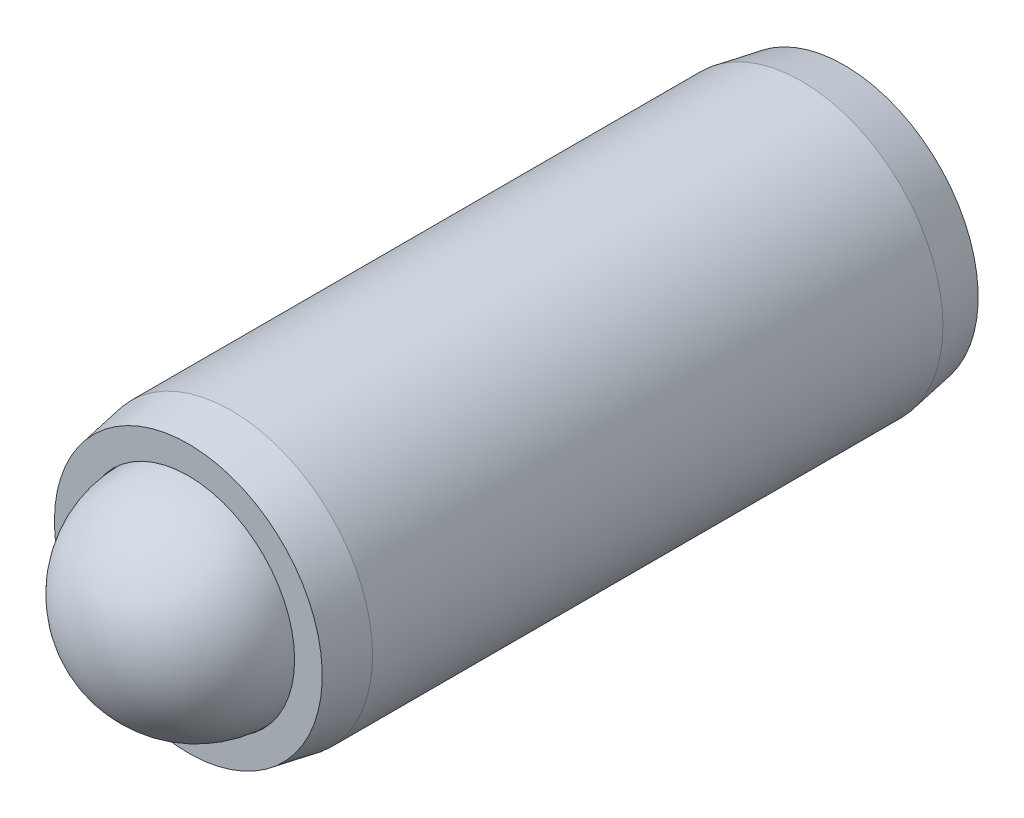
ISO-10303-21;
HEADER;
FILE_DESCRIPTION(('STEP AP214'),'2;1');
FILE_NAME('part.step','',(''),(''),'','','');
FILE_SCHEMA(('AUTOMOTIVE_DESIGN { 1 0 10303 214 1 1 1 1 }'));
ENDSEC;
DATA;
#1=APPLICATION_CONTEXT('core data for automotive mechanical design processes');
#2=APPLICATION_PROTOCOL_DEFINITION('international standard','automotive_design',2000,#1);
#3=PRODUCT_CONTEXT('',#1,'mechanical');
#4=PRODUCT('Part','Part','',(#3));
#5=PRODUCT_RELATED_PRODUCT_CATEGORY('part','',(#4));
#6=PRODUCT_DEFINITION_FORMATION('','',#4);
#7=PRODUCT_DEFINITION_CONTEXT('part definition',#1,'design');
#8=PRODUCT_DEFINITION('design','',#6,#7);
#9=PRODUCT_DEFINITION_SHAPE('','',#8);
#10=(LENGTH_UNIT() NAMED_UNIT(*) SI_UNIT(.MILLI.,.METRE.));
#11=(NAMED_UNIT(*) PLANE_ANGLE_UNIT() SI_UNIT($,.RADIAN.));
#12=(NAMED_UNIT(*) SI_UNIT($,.STERADIAN.) SOLID_ANGLE_UNIT());
#13=UNCERTAINTY_MEASURE_WITH_UNIT(LENGTH_MEASURE(1.E-05),#10,'distance_accuracy_value','');
#14=(GEOMETRIC_REPRESENTATION_CONTEXT(3) GLOBAL_UNCERTAINTY_ASSIGNED_CONTEXT((#13)) GLOBAL_UNIT_ASSIGNED_CONTEXT((#10,
#11,#12)) REPRESENTATION_CONTEXT('',''));
#15=CARTESIAN_POINT('',(0.,0.,0.));
#16=DIRECTION('',(0.,0.,1.));
#17=DIRECTION('',(1.,0.,0.));
#18=AXIS2_PLACEMENT_3D('',#15,#16,#17);
#19=CARTESIAN_POINT('',(12.4479058846987,0.114095203514354,4.14095762168604));
#20=DIRECTION('',(-0.501783450752555,0.0991728860270872,0.859289303568895));
#21=DIRECTION('',(0.424889384230263,0.893559081168465,0.144986825711152));
#22=AXIS2_PLACEMENT_3D('',#19,#20,#21);
#23=SPHERICAL_SURFACE('',#22,3.571875);
#24=CARTESIAN_POINT('',(10.6555981215419,0.468328355792356,7.21023160287119));
#25=VERTEX_POINT('',#24);
#26=VERTEX_LOOP('',#25);
#27=FACE_BOUND('',#26,.T.);
#28=ADVANCED_FACE('P0_F12',(#27),#23,.T.);
#29=CLOSED_SHELL('',(#28));
#30=MANIFOLD_SOLID_BREP('P0_B1',#29);
#31=CARTESIAN_POINT('',(12.4479058846987,0.114095203514353,-17.687167378314));
#32=DIRECTION('',(0.,0.,1.));
#33=DIRECTION('',(1.,0.,0.));
#34=AXIS2_PLACEMENT_3D('',#31,#32,#33);
#35=CONICAL_SURFACE('',#34,4.5085,0.174532925199426);
#36=CARTESIAN_POINT('',(12.4479058846987,0.114095203514353,-16.246661796131));
#37=DIRECTION('',(0.,0.,-1.));
#38=DIRECTION('',(-1.,0.,0.));
#39=AXIS2_PLACEMENT_3D('',#36,#37,#38);
#40=CIRCLE('',#39,4.7625);
#41=CARTESIAN_POINT('',(7.68540588469869,0.114095203514353,-16.246661796131));
#42=VERTEX_POINT('',#41);
#43=EDGE_CURVE('P1_E149',#42,#42,#40,.T.);
#44=ORIENTED_EDGE('',*,*,#43,.T.);
#45=EDGE_LOOP('',(#44));
#46=FACE_BOUND('',#45,.T.);
#47=CARTESIAN_POINT('',(12.4479058846987,0.114095203514353,-17.687167378314));
#48=DIRECTION('',(0.,0.,-1.));
#49=DIRECTION('',(-1.,0.,0.));
#50=AXIS2_PLACEMENT_3D('',#47,#48,#49);
#51=CIRCLE('',#50,4.5085);
#52=CARTESIAN_POINT('',(7.93940588469868,0.114095203514353,-17.687167378314));
#53=VERTEX_POINT('',#52);
#54=EDGE_CURVE('P1_E125',#53,#53,#51,.T.);
#55=ORIENTED_EDGE('',*,*,#54,.F.);
#56=EDGE_LOOP('',(#55));
#57=FACE_BOUND('',#56,.T.);
#58=ADVANCED_FACE('P1_F15',(#46,#57),#35,.T.);
#59=CARTESIAN_POINT('',(12.4479058846987,0.114095203514353,-0.910436446415391));
#60=DIRECTION('',(0.,0.,-1.));
#61=DIRECTION('',(-1.,0.,0.));
#62=AXIS2_PLACEMENT_3D('',#59,#60,#61);
#63=CYLINDRICAL_SURFACE('',#62,4.7625);
#64=CARTESIAN_POINT('',(12.4479058846987,0.114095203514353,2.95445203950315));
#65=DIRECTION('',(0.,0.,-1.));
#66=DIRECTION('',(-1.,0.,0.));
#67=AXIS2_PLACEMENT_3D('',#64,#65,#66);
#68=CIRCLE('',#67,4.7625);
#69=CARTESIAN_POINT('',(7.68540588469869,0.114095203514353,2.95445203950315));
#70=VERTEX_POINT('',#69);
#71=EDGE_CURVE('P1_E146',#70,#70,#68,.T.);
#72=ORIENTED_EDGE('',*,*,#71,.T.);
#73=EDGE_LOOP('',(#72));
#74=FACE_BOUND('',#73,.T.);
#75=ORIENTED_EDGE('',*,*,#43,.F.);
#76=EDGE_LOOP('',(#75));
#77=FACE_BOUND('',#76,.T.);
#78=ADVANCED_FACE('P1_F218',(#74,#77),#63,.T.);
#79=CARTESIAN_POINT('',(12.4479058846987,0.114095203514353,2.95445203950315));
#80=DIRECTION('',(0.,0.,-1.));
#81=DIRECTION('',(-1.,0.,0.));
#82=AXIS2_PLACEMENT_3D('',#79,#80,#81);
#83=CONICAL_SURFACE('',#82,4.7625,0.174532925199434);
#84=CARTESIAN_POINT('',(12.4479058846987,0.114095203514353,4.39495762168604));
#85=DIRECTION('',(0.,0.,-1.));
#86=DIRECTION('',(-1.,0.,0.));
#87=AXIS2_PLACEMENT_3D('',#84,#85,#86);
#88=CIRCLE('',#87,4.5085);
#89=CARTESIAN_POINT('',(7.93940588469868,0.114095203514353,4.39495762168604));
#90=VERTEX_POINT('',#89);
#91=EDGE_CURVE('P1_E143',#90,#90,#88,.T.);
#92=ORIENTED_EDGE('',*,*,#91,.T.);
#93=EDGE_LOOP('',(#92));
#94=FACE_BOUND('',#93,.T.);
#95=ORIENTED_EDGE('',*,*,#71,.F.);
#96=EDGE_LOOP('',(#95));
#97=FACE_BOUND('',#96,.T.);
#98=ADVANCED_FACE('P1_F224',(#94,#97),#83,.T.);
#99=CARTESIAN_POINT('',(12.4479058846987,4.62259520351435,4.39495762168604));
#100=DIRECTION('',(0.,0.,1.));
#101=DIRECTION('',(1.,0.,0.));
#102=AXIS2_PLACEMENT_3D('',#99,#100,#101);
#103=PLANE('',#102);
#104=CARTESIAN_POINT('',(12.4479058846987,0.114095203514353,4.39495762168604));
#105=DIRECTION('',(0.,0.,-1.));
#106=DIRECTION('',(-1.,0.,0.));
#107=AXIS2_PLACEMENT_3D('',#104,#105,#106);
#108=CIRCLE('',#107,3.578225);
#109=CARTESIAN_POINT('',(8.86968088469868,0.114095203514353,4.39495762168604));
#110=VERTEX_POINT('',#109);
#111=EDGE_CURVE('P1_E140',#110,#110,#108,.T.);
#112=ORIENTED_EDGE('',*,*,#111,.T.);
#113=EDGE_LOOP('',(#112));
#114=FACE_BOUND('',#113,.T.);
#115=ORIENTED_EDGE('',*,*,#91,.F.);
#116=EDGE_LOOP('',(#115));
#117=FACE_BOUND('',#116,.T.);
#118=ADVANCED_FACE('P1_F360',(#114,#117),#103,.T.);
#119=CARTESIAN_POINT('',(12.4479058846987,0.114095203514353,-0.910436446415391));
#120=DIRECTION('',(0.,0.,-1.));
#121=DIRECTION('',(-1.,0.,0.));
#122=AXIS2_PLACEMENT_3D('',#119,#120,#121);
#123=CYLINDRICAL_SURFACE('',#122,3.578225);
#124=CARTESIAN_POINT('',(12.4479058846987,0.114095203514353,2.66778855358465));
#125=DIRECTION('',(0.,0.,-1.));
#126=DIRECTION('',(-1.,0.,0.));
#127=AXIS2_PLACEMENT_3D('',#124,#125,#126);
#128=CIRCLE('',#127,3.578225);
#129=CARTESIAN_POINT('',(8.86968088469868,0.114095203514353,2.66778855358465));
#130=VERTEX_POINT('',#129);
#131=EDGE_CURVE('P1_E137',#130,#130,#128,.T.);
#132=ORIENTED_EDGE('',*,*,#131,.T.);
#133=EDGE_LOOP('',(#132));
#134=FACE_BOUND('',#133,.T.);
#135=ORIENTED_EDGE('',*,*,#111,.F.);
#136=EDGE_LOOP('',(#135));
#137=FACE_BOUND('',#136,.T.);
#138=ADVANCED_FACE('P1_F351',(#134,#137),#123,.F.);
#139=CARTESIAN_POINT('',(12.4479058846987,0.114095203514353,2.66778855358465));
#140=DIRECTION('',(0.,0.,1.));
#141=DIRECTION('',(1.,0.,0.));
#142=AXIS2_PLACEMENT_3D('',#139,#140,#141);
#143=CONICAL_SURFACE('',#142,3.578225,0.785398163397443);
#144=CARTESIAN_POINT('',(12.4479058846987,0.114095203514353,-0.910436446415391));
#145=VERTEX_POINT('',#144);
#146=VERTEX_LOOP('',#145);
#147=FACE_BOUND('',#146,.T.);
#148=ORIENTED_EDGE('',*,*,#131,.F.);
#149=EDGE_LOOP('',(#148));
#150=FACE_BOUND('',#149,.T.);
#151=ADVANCED_FACE('P1_F342',(#147,#150),#143,.F.);
#152=CARTESIAN_POINT('',(12.4479058846987,4.62259520351435,-17.687167378314));
#153=DIRECTION('',(0.,0.,-1.));
#154=DIRECTION('',(-1.,0.,0.));
#155=AXIS2_PLACEMENT_3D('',#152,#153,#154);
#156=PLANE('',#155);
#157=DIRECTION('',(1.,0.,0.));
#158=VECTOR('',#157,1.);
#159=CARTESIAN_POINT('',(13.8227212132065,-2.52115479648565,-17.687167378314));
#160=LINE('',#159,#158);
#161=CARTESIAN_POINT('',(10.9264435878167,-2.52115479648565,-17.687167378314));
#162=VERTEX_POINT('',#161);
#163=CARTESIAN_POINT('',(13.9693681815806,-2.52115479648565,-17.687167378314));
#164=VERTEX_POINT('',#163);
#165=EDGE_CURVE('P1_E163',#162,#164,#160,.T.);
#166=ORIENTED_EDGE('',*,*,#165,.T.);
#167=DIRECTION('',(0.5,0.866025403784439,0.));
#168=VECTOR('',#167,1.);
#169=CARTESIAN_POINT('',(15.4175069942755,-0.0129047964856495,-17.687167378314));
#170=LINE('',#169,#168);
#171=CARTESIAN_POINT('',(15.4908304784626,0.114095203514353,-17.687167378314));
#172=VERTEX_POINT('',#171);
#173=EDGE_CURVE('P1_E165',#164,#172,#170,.T.);
#174=ORIENTED_EDGE('',*,*,#173,.T.);
#175=DIRECTION('',(-0.5,0.866025403784439,0.));
#176=VECTOR('',#175,1.);
#177=CARTESIAN_POINT('',(14.0426916657677,2.62234520351436,-17.687167378314));
#178=LINE('',#177,#176);
#179=CARTESIAN_POINT('',(13.9693681815806,2.74934520351436,-17.687167378314));
#180=VERTEX_POINT('',#179);
#181=EDGE_CURVE('P1_E155',#172,#180,#178,.T.);
#182=ORIENTED_EDGE('',*,*,#181,.T.);
#183=DIRECTION('',(-1.,0.,0.));
#184=VECTOR('',#183,1.);
#185=CARTESIAN_POINT('',(11.0730905561909,2.74934520351436,-17.687167378314));
#186=LINE('',#185,#184);
#187=CARTESIAN_POINT('',(10.9264435878167,2.74934520351436,-17.687167378314));
#188=VERTEX_POINT('',#187);
#189=EDGE_CURVE('P1_E157',#180,#188,#186,.T.);
#190=ORIENTED_EDGE('',*,*,#189,.T.);
#191=DIRECTION('',(-0.5,-0.866025403784438,0.));
#192=VECTOR('',#191,1.);
#193=CARTESIAN_POINT('',(9.47830477512184,0.241095203514354,-17.687167378314));
#194=LINE('',#193,#192);
#195=CARTESIAN_POINT('',(9.40498129093475,0.114095203514352,-17.687167378314));
#196=VERTEX_POINT('',#195);
#197=EDGE_CURVE('P1_E159',#188,#196,#194,.T.);
#198=ORIENTED_EDGE('',*,*,#197,.T.);
#199=DIRECTION('',(0.5,-0.866025403784439,0.));
#200=VECTOR('',#199,1.);
#201=CARTESIAN_POINT('',(10.8531201036296,-2.39415479648565,-17.687167378314));
#202=LINE('',#201,#200);
#203=EDGE_CURVE('P1_E161',#196,#162,#202,.T.);
#204=ORIENTED_EDGE('',*,*,#203,.T.);
#205=EDGE_LOOP('',(#166,#174,#182,#190,#198,#204));
#206=FACE_BOUND('',#205,.T.);
#207=ORIENTED_EDGE('',*,*,#54,.T.);
#208=EDGE_LOOP('',(#207));
#209=FACE_BOUND('',#208,.T.);
#210=ADVANCED_FACE('P1_F334',(#206,#209),#156,.T.);
#211=CARTESIAN_POINT('',(11.0730905561909,-2.26715479648565,-12.607167378314));
#212=DIRECTION('',(-0.866025403784439,-0.5,0.));
#213=DIRECTION('',(0.5,-0.866025403784439,0.));
#214=AXIS2_PLACEMENT_3D('',#211,#212,#213);
#215=PLANE('',#214);
#216=DIRECTION('',(0.,0.,-1.));
#217=VECTOR('',#216,1.);
#218=CARTESIAN_POINT('',(11.0730905561909,-2.26715479648565,-12.607167378314));
#219=LINE('',#218,#217);
#220=CARTESIAN_POINT('',(11.0730905561909,-2.26715479648565,-12.607167378314));
#221=VERTEX_POINT('',#220);
#222=CARTESIAN_POINT('',(11.0730905561909,-2.26715479648565,-17.433167378314));
#223=VERTEX_POINT('',#222);
#224=EDGE_CURVE('P1_E123',#221,#223,#219,.T.);
#225=ORIENTED_EDGE('',*,*,#224,.T.);
#226=DIRECTION('',(-0.5,0.866025403784439,0.));
#227=VECTOR('',#226,1.);
#228=CARTESIAN_POINT('',(9.69827522768309,0.114095203514351,-17.433167378314));
#229=LINE('',#228,#227);
#230=CARTESIAN_POINT('',(9.69827522768309,0.114095203514352,-17.433167378314));
#231=VERTEX_POINT('',#230);
#232=EDGE_CURVE('P1_E97',#223,#231,#229,.T.);
#233=ORIENTED_EDGE('',*,*,#232,.T.);
#234=DIRECTION('',(0.,0.,-1.));
#235=VECTOR('',#234,1.);
#236=CARTESIAN_POINT('',(9.69827522768309,0.114095203514352,-12.607167378314));
#237=LINE('',#236,#235);
#238=CARTESIAN_POINT('',(9.69827522768309,0.114095203514352,-12.607167378314));
#239=VERTEX_POINT('',#238);
#240=EDGE_CURVE('P1_E89',#239,#231,#237,.T.);
#241=ORIENTED_EDGE('',*,*,#240,.F.);
#242=DIRECTION('',(-0.5,0.866025403784439,0.));
#243=VECTOR('',#242,1.);
#244=CARTESIAN_POINT('',(11.0730905561909,-2.26715479648565,-12.607167378314));
#245=LINE('',#244,#243);
#246=EDGE_CURVE('P1_E94',#221,#239,#245,.T.);
#247=ORIENTED_EDGE('',*,*,#246,.F.);
#248=EDGE_LOOP('',(#225,#233,#241,#247));
#249=FACE_BOUND('',#248,.T.);
#250=ADVANCED_FACE('P1_F92',(#249),#215,.F.);
#251=CARTESIAN_POINT('',(13.8227212132065,-2.26715479648565,-12.607167378314));
#252=DIRECTION('',(0.,-1.,0.));
#253=DIRECTION('',(1.,0.,0.));
#254=AXIS2_PLACEMENT_3D('',#251,#252,#253);
#255=PLANE('',#254);
#256=DIRECTION('',(0.,0.,-1.));
#257=VECTOR('',#256,1.);
#258=CARTESIAN_POINT('',(13.8227212132065,-2.26715479648565,-12.607167378314));
#259=LINE('',#258,#257);
#260=CARTESIAN_POINT('',(13.8227212132065,-2.26715479648565,-12.607167378314));
#261=VERTEX_POINT('',#260);
#262=CARTESIAN_POINT('',(13.8227212132065,-2.26715479648565,-17.433167378314));
#263=VERTEX_POINT('',#262);
#264=EDGE_CURVE('P1_E126',#261,#263,#259,.T.);
#265=ORIENTED_EDGE('',*,*,#264,.T.);
#266=DIRECTION('',(-1.,0.,0.));
#267=VECTOR('',#266,1.);
#268=CARTESIAN_POINT('',(11.0730905561909,-2.26715479648565,-17.433167378314));
#269=LINE('',#268,#267);
#270=EDGE_CURVE('P1_E168',#263,#223,#269,.T.);
#271=ORIENTED_EDGE('',*,*,#270,.T.);
#272=ORIENTED_EDGE('',*,*,#224,.F.);
#273=DIRECTION('',(-1.,0.,0.));
#274=VECTOR('',#273,1.);
#275=CARTESIAN_POINT('',(13.8227212132065,-2.26715479648565,-12.607167378314));
#276=LINE('',#275,#274);
#277=EDGE_CURVE('P1_E99',#261,#221,#276,.T.);
#278=ORIENTED_EDGE('',*,*,#277,.F.);
#279=EDGE_LOOP('',(#265,#271,#272,#278));
#280=FACE_BOUND('',#279,.T.);
#281=ADVANCED_FACE('P1_F252',(#280),#255,.F.);
#282=CARTESIAN_POINT('',(15.1975365417143,0.114095203514353,-12.607167378314));
#283=DIRECTION('',(0.866025403784438,-0.5,0.));
#284=DIRECTION('',(0.5,0.866025403784438,0.));
#285=AXIS2_PLACEMENT_3D('',#282,#283,#284);
#286=PLANE('',#285);
#287=DIRECTION('',(0.,0.,-1.));
#288=VECTOR('',#287,1.);
#289=CARTESIAN_POINT('',(15.1975365417143,0.114095203514353,-12.607167378314));
#290=LINE('',#289,#288);
#291=CARTESIAN_POINT('',(15.1975365417143,0.114095203514353,-12.607167378314));
#292=VERTEX_POINT('',#291);
#293=CARTESIAN_POINT('',(15.1975365417143,0.114095203514353,-17.433167378314));
#294=VERTEX_POINT('',#293);
#295=EDGE_CURVE('P1_E129',#292,#294,#290,.T.);
#296=ORIENTED_EDGE('',*,*,#295,.T.);
#297=DIRECTION('',(-0.5,-0.866025403784438,0.));
#298=VECTOR('',#297,1.);
#299=CARTESIAN_POINT('',(13.8227212132065,-2.26715479648565,-17.433167378314));
#300=LINE('',#299,#298);
#301=EDGE_CURVE('P1_E152',#294,#263,#300,.T.);
#302=ORIENTED_EDGE('',*,*,#301,.T.);
#303=ORIENTED_EDGE('',*,*,#264,.F.);
#304=DIRECTION('',(-0.5,-0.866025403784438,0.));
#305=VECTOR('',#304,1.);
#306=CARTESIAN_POINT('',(15.1975365417143,0.114095203514353,-12.607167378314));
#307=LINE('',#306,#305);
#308=EDGE_CURVE('P1_E120',#292,#261,#307,.T.);
#309=ORIENTED_EDGE('',*,*,#308,.F.);
#310=EDGE_LOOP('',(#296,#302,#303,#309));
#311=FACE_BOUND('',#310,.T.);
#312=ADVANCED_FACE('P1_F206',(#311),#286,.F.);
#313=CARTESIAN_POINT('',(13.8227212132065,2.49534520351435,-12.607167378314));
#314=DIRECTION('',(0.866025403784438,0.5,0.));
#315=DIRECTION('',(-0.5,0.866025403784439,0.));
#316=AXIS2_PLACEMENT_3D('',#313,#314,#315);
#317=PLANE('',#316);
#318=DIRECTION('',(0.,0.,-1.));
#319=VECTOR('',#318,1.);
#320=CARTESIAN_POINT('',(13.8227212132065,2.49534520351435,-12.607167378314));
#321=LINE('',#320,#319);
#322=CARTESIAN_POINT('',(13.8227212132065,2.49534520351435,-12.607167378314));
#323=VERTEX_POINT('',#322);
#324=CARTESIAN_POINT('',(13.8227212132065,2.49534520351435,-17.433167378314));
#325=VERTEX_POINT('',#324);
#326=EDGE_CURVE('P1_E132',#323,#325,#321,.T.);
#327=ORIENTED_EDGE('',*,*,#326,.T.);
#328=DIRECTION('',(0.5,-0.866025403784439,0.));
#329=VECTOR('',#328,1.);
#330=CARTESIAN_POINT('',(15.1975365417143,0.114095203514353,-17.433167378314));
#331=LINE('',#330,#329);
#332=EDGE_CURVE('P1_E10',#325,#294,#331,.T.);
#333=ORIENTED_EDGE('',*,*,#332,.T.);
#334=ORIENTED_EDGE('',*,*,#295,.F.);
#335=DIRECTION('',(0.5,-0.866025403784439,0.));
#336=VECTOR('',#335,1.);
#337=CARTESIAN_POINT('',(13.8227212132065,2.49534520351435,-12.607167378314));
#338=LINE('',#337,#336);
#339=EDGE_CURVE('P1_E117',#323,#292,#338,.T.);
#340=ORIENTED_EDGE('',*,*,#339,.F.);
#341=EDGE_LOOP('',(#327,#333,#334,#340));
#342=FACE_BOUND('',#341,.T.);
#343=ADVANCED_FACE('P1_F202',(#342),#317,.F.);
#344=CARTESIAN_POINT('',(11.0730905561909,2.49534520351435,-12.607167378314));
#345=DIRECTION('',(0.,1.,0.));
#346=DIRECTION('',(0.,0.,1.));
#347=AXIS2_PLACEMENT_3D('',#344,#345,#346);
#348=PLANE('',#347);
#349=DIRECTION('',(0.,0.,-1.));
#350=VECTOR('',#349,1.);
#351=CARTESIAN_POINT('',(11.0730905561909,2.49534520351435,-12.607167378314));
#352=LINE('',#351,#350);
#353=CARTESIAN_POINT('',(11.0730905561909,2.49534520351435,-12.607167378314));
#354=VERTEX_POINT('',#353);
#355=CARTESIAN_POINT('',(11.0730905561909,2.49534520351435,-17.433167378314));
#356=VERTEX_POINT('',#355);
#357=EDGE_CURVE('P1_E98',#354,#356,#352,.T.);
#358=ORIENTED_EDGE('',*,*,#357,.T.);
#359=DIRECTION('',(1.,0.,0.));
#360=VECTOR('',#359,1.);
#361=CARTESIAN_POINT('',(13.8227212132065,2.49534520351435,-17.433167378314));
#362=LINE('',#361,#360);
#363=EDGE_CURVE('P1_E24',#356,#325,#362,.T.);
#364=ORIENTED_EDGE('',*,*,#363,.T.);
#365=ORIENTED_EDGE('',*,*,#326,.F.);
#366=DIRECTION('',(1.,0.,0.));
#367=VECTOR('',#366,1.);
#368=CARTESIAN_POINT('',(11.0730905561909,2.49534520351435,-12.607167378314));
#369=LINE('',#368,#367);
#370=EDGE_CURVE('P1_E107',#354,#323,#369,.T.);
#371=ORIENTED_EDGE('',*,*,#370,.F.);
#372=EDGE_LOOP('',(#358,#364,#365,#371));
#373=FACE_BOUND('',#372,.T.);
#374=ADVANCED_FACE('P1_F207',(#373),#348,.F.);
#375=CARTESIAN_POINT('',(9.69827522768309,0.114095203514352,-12.607167378314));
#376=DIRECTION('',(-0.866025403784438,0.5,0.));
#377=DIRECTION('',(-0.5,-0.866025403784438,0.));
#378=AXIS2_PLACEMENT_3D('',#375,#376,#377);
#379=PLANE('',#378);
#380=ORIENTED_EDGE('',*,*,#240,.T.);
#381=DIRECTION('',(0.5,0.866025403784438,0.));
#382=VECTOR('',#381,1.);
#383=CARTESIAN_POINT('',(11.0730905561909,2.49534520351435,-17.433167378314));
#384=LINE('',#383,#382);
#385=EDGE_CURVE('P1_E39',#231,#356,#384,.T.);
#386=ORIENTED_EDGE('',*,*,#385,.T.);
#387=ORIENTED_EDGE('',*,*,#357,.F.);
#388=DIRECTION('',(0.5,0.866025403784438,0.));
#389=VECTOR('',#388,1.);
#390=CARTESIAN_POINT('',(9.69827522768309,0.114095203514352,-12.607167378314));
#391=LINE('',#390,#389);
#392=EDGE_CURVE('P1_E102',#239,#354,#391,.T.);
#393=ORIENTED_EDGE('',*,*,#392,.F.);
#394=EDGE_LOOP('',(#380,#386,#387,#393));
#395=FACE_BOUND('',#394,.T.);
#396=ADVANCED_FACE('P1_F103',(#395),#379,.F.);
#397=CARTESIAN_POINT('',(12.4479058846987,0.114095203514353,-12.607167378314));
#398=DIRECTION('',(0.,0.,-1.));
#399=DIRECTION('',(0.,1.,0.));
#400=AXIS2_PLACEMENT_3D('',#397,#398,#399);
#401=PLANE('',#400);
#402=ORIENTED_EDGE('',*,*,#246,.T.);
#403=ORIENTED_EDGE('',*,*,#392,.T.);
#404=ORIENTED_EDGE('',*,*,#370,.T.);
#405=ORIENTED_EDGE('',*,*,#339,.T.);
#406=ORIENTED_EDGE('',*,*,#308,.T.);
#407=ORIENTED_EDGE('',*,*,#277,.T.);
#408=EDGE_LOOP('',(#402,#403,#404,#405,#406,#407));
#409=FACE_BOUND('',#408,.T.);
#410=ADVANCED_FACE('P1_F109',(#409),#401,.T.);
#411=CARTESIAN_POINT('',(9.69827522768309,0.114095203514352,-17.433167378314));
#412=DIRECTION('',(0.612372435695789,-0.353553390593271,-0.707106781186554));
#413=DIRECTION('',(-0.5,-0.866025403784438,0.));
#414=AXIS2_PLACEMENT_3D('',#411,#412,#413);
#415=PLANE('',#414);
#416=DIRECTION('',(-0.755928946018461,0.,-0.65465367070797));
#417=VECTOR('',#416,1.);
#418=CARTESIAN_POINT('',(10.4838839868304,0.114095203514352,-16.7528102354568));
#419=LINE('',#418,#417);
#420=EDGE_CURVE('P1_E114',#196,#231,#419,.F.);
#421=ORIENTED_EDGE('',*,*,#420,.F.);
#422=ORIENTED_EDGE('',*,*,#197,.F.);
#423=DIRECTION('',(-0.377964473009229,0.654653670707983,-0.65465367070797));
#424=VECTOR('',#423,1.);
#425=CARTESIAN_POINT('',(11.4658949357646,1.8149880606572,-16.7528102354568));
#426=LINE('',#425,#424);
#427=EDGE_CURVE('P1_E19',#356,#188,#426,.T.);
#428=ORIENTED_EDGE('',*,*,#427,.F.);
#429=ORIENTED_EDGE('',*,*,#385,.F.);
#430=EDGE_LOOP('',(#421,#422,#428,#429));
#431=FACE_BOUND('',#430,.T.);
#432=ADVANCED_FACE('P1_F17',(#431),#415,.T.);
#433=CARTESIAN_POINT('',(11.0730905561909,2.49534520351435,-17.433167378314));
#434=DIRECTION('',(0.,-0.70710678118654,-0.707106781186555));
#435=DIRECTION('',(-1.,0.,0.));
#436=AXIS2_PLACEMENT_3D('',#433,#434,#435);
#437=PLANE('',#436);
#438=ORIENTED_EDGE('',*,*,#427,.T.);
#439=ORIENTED_EDGE('',*,*,#189,.F.);
#440=DIRECTION('',(0.377964473009228,0.654653670707984,-0.65465367070797));
#441=VECTOR('',#440,1.);
#442=CARTESIAN_POINT('',(13.4299168336328,1.8149880606572,-16.7528102354568));
#443=LINE('',#442,#441);
#444=EDGE_CURVE('P1_E180',#325,#180,#443,.T.);
#445=ORIENTED_EDGE('',*,*,#444,.F.);
#446=ORIENTED_EDGE('',*,*,#363,.F.);
#447=EDGE_LOOP('',(#438,#439,#445,#446));
#448=FACE_BOUND('',#447,.T.);
#449=ADVANCED_FACE('P1_F194',(#448),#437,.T.);
#450=CARTESIAN_POINT('',(11.0730905561909,-2.26715479648565,-17.433167378314));
#451=DIRECTION('',(0.612372435695789,0.353553390593271,-0.707106781186554));
#452=DIRECTION('',(0.5,-0.866025403784439,0.));
#453=AXIS2_PLACEMENT_3D('',#450,#451,#452);
#454=PLANE('',#453);
#455=ORIENTED_EDGE('',*,*,#420,.T.);
#456=ORIENTED_EDGE('',*,*,#232,.F.);
#457=DIRECTION('',(-0.377964473009231,-0.654653670707981,-0.654653670707971));
#458=VECTOR('',#457,1.);
#459=CARTESIAN_POINT('',(11.4658949357646,-1.58679765362849,-16.7528102354568));
#460=LINE('',#459,#458);
#461=EDGE_CURVE('P1_E177',#162,#223,#460,.F.);
#462=ORIENTED_EDGE('',*,*,#461,.F.);
#463=ORIENTED_EDGE('',*,*,#203,.F.);
#464=EDGE_LOOP('',(#455,#456,#462,#463));
#465=FACE_BOUND('',#464,.T.);
#466=ADVANCED_FACE('P1_F186',(#465),#454,.T.);
#467=CARTESIAN_POINT('',(13.8227212132065,2.49534520351435,-17.433167378314));
#468=DIRECTION('',(-0.612372435695789,-0.353553390593271,-0.707106781186553));
#469=DIRECTION('',(-0.5,0.866025403784439,0.));
#470=AXIS2_PLACEMENT_3D('',#467,#468,#469);
#471=PLANE('',#470);
#472=ORIENTED_EDGE('',*,*,#444,.T.);
#473=ORIENTED_EDGE('',*,*,#181,.F.);
#474=DIRECTION('',(-0.75592894601846,0.,0.654653670707971));
#475=VECTOR('',#474,1.);
#476=CARTESIAN_POINT('',(15.1975365417143,0.114095203514353,-17.433167378314));
#477=LINE('',#476,#475);
#478=EDGE_CURVE('P1_E175',#294,#172,#477,.F.);
#479=ORIENTED_EDGE('',*,*,#478,.F.);
#480=ORIENTED_EDGE('',*,*,#332,.F.);
#481=EDGE_LOOP('',(#472,#473,#479,#480));
#482=FACE_BOUND('',#481,.T.);
#483=ADVANCED_FACE('P1_F199',(#482),#471,.T.);
#484=CARTESIAN_POINT('',(13.8227212132065,-2.26715479648565,-17.433167378314));
#485=DIRECTION('',(0.,0.707106781186542,-0.707106781186553));
#486=DIRECTION('',(1.,0.,0.));
#487=AXIS2_PLACEMENT_3D('',#484,#485,#486);
#488=PLANE('',#487);
#489=ORIENTED_EDGE('',*,*,#461,.T.);
#490=ORIENTED_EDGE('',*,*,#270,.F.);
#491=DIRECTION('',(0.37796447300923,-0.654653670707982,-0.654653670707971));
#492=VECTOR('',#491,1.);
#493=CARTESIAN_POINT('',(13.4299168336328,-1.5867976536285,-16.7528102354568));
#494=LINE('',#493,#492);
#495=EDGE_CURVE('P1_E173',#164,#263,#494,.F.);
#496=ORIENTED_EDGE('',*,*,#495,.F.);
#497=ORIENTED_EDGE('',*,*,#165,.F.);
#498=EDGE_LOOP('',(#489,#490,#496,#497));
#499=FACE_BOUND('',#498,.T.);
#500=ADVANCED_FACE('P1_F233',(#499),#488,.T.);
#501=CARTESIAN_POINT('',(15.1975365417143,0.114095203514353,-17.433167378314));
#502=DIRECTION('',(-0.612372435695789,0.353553390593271,-0.707106781186553));
#503=DIRECTION('',(0.5,0.866025403784438,0.));
#504=AXIS2_PLACEMENT_3D('',#501,#502,#503);
#505=PLANE('',#504);
#506=ORIENTED_EDGE('',*,*,#478,.T.);
#507=ORIENTED_EDGE('',*,*,#173,.F.);
#508=ORIENTED_EDGE('',*,*,#495,.T.);
#509=ORIENTED_EDGE('',*,*,#301,.F.);
#510=EDGE_LOOP('',(#506,#507,#508,#509));
#511=FACE_BOUND('',#510,.T.);
#512=ADVANCED_FACE('P1_F230',(#511),#505,.T.);
#513=CLOSED_SHELL('',(#58,#78,#98,#118,#138,#151,#210,#250,#281,#312,#343,#374,#396,#410,#432,
#449,#466,#483,#500,#512));
#514=MANIFOLD_SOLID_BREP('P1_B1',#513);
#515=ADVANCED_BREP_SHAPE_REPRESENTATION('',(#18,#30,#514),#14);
#516=SHAPE_DEFINITION_REPRESENTATION(#9,#515);
ENDSEC;
END-ISO-10303-21;
